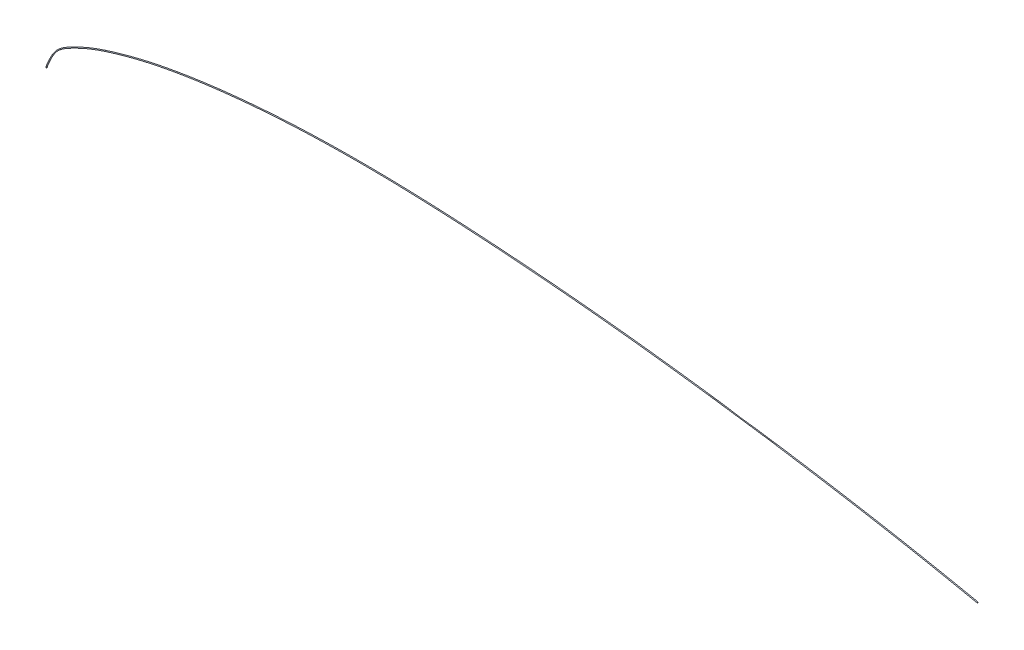
ISO-10303-21;
HEADER;
FILE_DESCRIPTION(('STEP AP214'),'2;1');
FILE_NAME('part.step','',(''),(''),'','','');
FILE_SCHEMA(('AUTOMOTIVE_DESIGN { 1 0 10303 214 1 1 1 1 }'));
ENDSEC;
DATA;
#1=APPLICATION_CONTEXT('core data for automotive mechanical design processes');
#2=APPLICATION_PROTOCOL_DEFINITION('international standard','automotive_design',2000,#1);
#3=PRODUCT_CONTEXT('',#1,'mechanical');
#4=PRODUCT('Part','Part','',(#3));
#5=PRODUCT_RELATED_PRODUCT_CATEGORY('part','',(#4));
#6=PRODUCT_DEFINITION_FORMATION('','',#4);
#7=PRODUCT_DEFINITION_CONTEXT('part definition',#1,'design');
#8=PRODUCT_DEFINITION('design','',#6,#7);
#9=PRODUCT_DEFINITION_SHAPE('','',#8);
#10=(LENGTH_UNIT() NAMED_UNIT(*) SI_UNIT(.MILLI.,.METRE.));
#11=(NAMED_UNIT(*) PLANE_ANGLE_UNIT() SI_UNIT($,.RADIAN.));
#12=(NAMED_UNIT(*) SI_UNIT($,.STERADIAN.) SOLID_ANGLE_UNIT());
#13=UNCERTAINTY_MEASURE_WITH_UNIT(LENGTH_MEASURE(1.E-05),#10,'distance_accuracy_value','');
#14=(GEOMETRIC_REPRESENTATION_CONTEXT(3) GLOBAL_UNCERTAINTY_ASSIGNED_CONTEXT((#13)) GLOBAL_UNIT_ASSIGNED_CONTEXT((#10,
#11,#12)) REPRESENTATION_CONTEXT('',''));
#15=CARTESIAN_POINT('',(0.,0.,0.));
#16=DIRECTION('',(0.,0.,1.));
#17=DIRECTION('',(1.,0.,0.));
#18=AXIS2_PLACEMENT_3D('',#15,#16,#17);
#19=CARTESIAN_POINT('',(982.37,1.277081,0.));
#20=DIRECTION('',(0.98101772640487,0.193918076721638,0.));
#21=DIRECTION('',(0.,0.,1.));
#22=AXIS2_PLACEMENT_3D('',#19,#20,#21);
#23=PLANE('',#22);
#24=CARTESIAN_POINT('',(982.37,1.277081,0.));
#25=DIRECTION('',(0.98101772640487,0.193918076721638,0.));
#26=DIRECTION('',(0.,0.,1.));
#27=AXIS2_PLACEMENT_3D('',#24,#25,#26);
#28=CIRCLE('',#27,0.5);
#29=CARTESIAN_POINT('',(982.37,1.277081,0.5));
#30=VERTEX_POINT('',#29);
#31=EDGE_CURVE('E10',#30,#30,#28,.T.);
#32=ORIENTED_EDGE('',*,*,#31,.T.);
#33=EDGE_LOOP('',(#32));
#34=FACE_BOUND('',#33,.T.);
#35=ADVANCED_FACE('F39',(#34),#23,.T.);
#36=CARTESIAN_POINT('',(982.37,1.277081,0.5));
#37=CARTESIAN_POINT('',(966.006247692632,4.63023753531084,0.5));
#38=CARTESIAN_POINT('',(949.64249538203,7.98339407107312,0.5));
#39=CARTESIAN_POINT('',(884.325588967302,20.7974180113734,0.5));
#40=CARTESIAN_POINT('',(835.170749762555,29.2208354174456,0.5));
#41=CARTESIAN_POINT('',(753.204713954217,41.8930561435161,0.5));
#42=CARTESIAN_POINT('',(720.457598988852,46.5816054311459,0.5));
#43=CARTESIAN_POINT('',(654.965430300209,55.178140371645,0.5));
#44=CARTESIAN_POINT('',(622.220705780157,59.088577507133,0.5));
#45=CARTESIAN_POINT('',(556.72340320794,65.8585389828754,0.5));
#46=CARTESIAN_POINT('',(523.971154173901,68.7212345165416,0.5));
#47=CARTESIAN_POINT('',(458.473890529683,73.5204427017436,0.5));
#48=CARTESIAN_POINT('',(425.729030955599,75.4590603090154,0.5));
#49=CARTESIAN_POINT('',(360.217201786401,77.7888732518948,0.5));
#50=CARTESIAN_POINT('',(327.450342968571,78.1824352617219,0.5));
#51=CARTESIAN_POINT('',(261.903332539602,76.6374663029844,0.5));
#52=CARTESIAN_POINT('',(229.113072819916,74.7211664786091,0.5));
#53=CARTESIAN_POINT('',(179.965527901329,69.5998220072903,0.5));
#54=CARTESIAN_POINT('',(163.498338532072,67.4928260856141,0.5));
#55=CARTESIAN_POINT('',(130.697575950852,62.2949459092975,0.5));
#56=CARTESIAN_POINT('',(114.364585446865,59.2029975403183,0.5));
#57=CARTESIAN_POINT('',(89.9285245792287,53.3005454090448,0.5));
#58=CARTESIAN_POINT('',(81.6745496994335,51.0803969997088,0.5));
#59=CARTESIAN_POINT('',(65.2472627690558,46.243098791399,0.5));
#60=CARTESIAN_POINT('',(57.0755665289918,43.6238149687629,0.5));
#61=CARTESIAN_POINT('',(43.9833416859353,38.6022903177345,0.5));
#62=CARTESIAN_POINT('',(38.9375739069987,36.4525063723427,0.5));
#63=CARTESIAN_POINT('',(31.4498674362683,32.913379283491,0.5));
#64=CARTESIAN_POINT('',(28.9674561457282,31.681261725483,0.5));
#65=CARTESIAN_POINT('',(24.0207585296471,29.1048493398776,0.5));
#66=CARTESIAN_POINT('',(21.5337905450468,27.7759853581103,0.5));
#67=CARTESIAN_POINT('',(16.7882920380453,24.8496141050762,0.5));
#68=CARTESIAN_POINT('',(14.5377722111785,23.2466569766948,0.5));
#69=CARTESIAN_POINT('',(10.5905898574913,19.5373232835405,0.5));
#70=CARTESIAN_POINT('',(8.90492918725965,17.4222238719549,0.5));
#71=CARTESIAN_POINT('',(4.42778144185482,10.5529103062656,0.5));
#72=CARTESIAN_POINT('',(2.21389071966054,5.27645515427274,0.5));
#73=CARTESIAN_POINT('',(0.,0.,0.5));
#74=CARTESIAN_POINT('',(982.563918076722,0.29606327359513,0.5));
#75=CARTESIAN_POINT('',(966.200165767499,3.64921980892499,0.5));
#76=CARTESIAN_POINT('',(949.839160604952,7.00290740477424,0.5));
#77=CARTESIAN_POINT('',(884.544092714158,19.8214389613463,0.5));
#78=CARTESIAN_POINT('',(835.40131775265,28.2477143375043,0.5));
#79=CARTESIAN_POINT('',(753.453418381785,40.9244480332833,0.5));
#80=CARTESIAN_POINT('',(720.713682314235,45.6149192850411,0.5));
#81=CARTESIAN_POINT('',(655.236529757715,54.2155576629643,0.5));
#82=CARTESIAN_POINT('',(622.500629401233,58.1284969837561,0.5));
#83=CARTESIAN_POINT('',(557.023538067243,64.9045839369948,0.5));
#84=CARTESIAN_POINT('',(524.280762680364,67.7703243225816,0.5));
#85=CARTESIAN_POINT('',(458.801225424324,72.5754881578468,0.5));
#86=CARTESIAN_POINT('',(426.06821064823,74.5182073184651,0.5));
#87=CARTESIAN_POINT('',(360.58577013235,76.8591400470335,0.5));
#88=CARTESIAN_POINT('',(327.837209483476,77.2599943142502,0.5));
#89=CARTESIAN_POINT('',(262.333558984971,75.7344322172876,0.5));
#90=CARTESIAN_POINT('',(229.566371993328,73.8292730265615,0.5));
#91=CARTESIAN_POINT('',(180.459619649967,68.730271884403,0.5));
#92=CARTESIAN_POINT('',(164.007817596871,66.6321112630241,0.5));
#93=CARTESIAN_POINT('',(131.241017201513,61.4552611290608,0.5));
#94=CARTESIAN_POINT('',(114.930337108243,58.3777486950091,0.5));
#95=CARTESIAN_POINT('',(90.5349492372928,52.5052191305762,0.5));
#96=CARTESIAN_POINT('',(82.2938385739548,50.2950726401932,0.5));
#97=CARTESIAN_POINT('',(65.8912176146056,45.4778699258685,0.5));
#98=CARTESIAN_POINT('',(57.7398604672087,42.8753977992402,0.5));
#99=CARTESIAN_POINT('',(44.6923426157801,37.8966651450928,0.5));
#100=CARTESIAN_POINT('',(39.664263852104,35.7650613796964,0.5));
#101=CARTESIAN_POINT('',(32.2022911793308,32.2545748857836,0.5));
#102=CARTESIAN_POINT('',(29.7283254048874,31.0322284458354,0.5));
#103=CARTESIAN_POINT('',(24.7981079747776,28.475648205275,0.5));
#104=CARTESIAN_POINT('',(22.3216395958269,27.1585617769766,0.5));
#105=CARTESIAN_POINT('',(17.6271013267159,24.3034300862453,0.5));
#106=CARTESIAN_POINT('',(15.4138163425942,22.7557596830098,0.5));
#107=CARTESIAN_POINT('',(11.5413894191943,19.2141922479197,0.5));
#108=CARTESIAN_POINT('',(9.87748593080348,17.1812874766036,0.5));
#109=CARTESIAN_POINT('',(5.43401535512678,10.4966859659683,0.5));
#110=CARTESIAN_POINT('',(3.21389071965992,5.27645515427274,0.5));
#111=CARTESIAN_POINT('',(1.,0.,0.5));
#112=CARTESIAN_POINT('',(982.563918076722,0.29606327359513,-0.5));
#113=CARTESIAN_POINT('',(966.200165767499,3.64921980892499,-0.5));
#114=CARTESIAN_POINT('',(949.839160604952,7.00290740477424,-0.5));
#115=CARTESIAN_POINT('',(884.544092714158,19.8214389613463,-0.5));
#116=CARTESIAN_POINT('',(835.40131775265,28.2477143375043,-0.5));
#117=CARTESIAN_POINT('',(753.453418381785,40.9244480332833,-0.5));
#118=CARTESIAN_POINT('',(720.713682314235,45.6149192850411,-0.5));
#119=CARTESIAN_POINT('',(655.236529757715,54.2155576629643,-0.5));
#120=CARTESIAN_POINT('',(622.500629401233,58.1284969837561,-0.5));
#121=CARTESIAN_POINT('',(557.023538067243,64.9045839369948,-0.5));
#122=CARTESIAN_POINT('',(524.280762680364,67.7703243225816,-0.5));
#123=CARTESIAN_POINT('',(458.801225424324,72.5754881578468,-0.5));
#124=CARTESIAN_POINT('',(426.06821064823,74.5182073184651,-0.5));
#125=CARTESIAN_POINT('',(360.58577013235,76.8591400470335,-0.5));
#126=CARTESIAN_POINT('',(327.837209483476,77.2599943142502,-0.5));
#127=CARTESIAN_POINT('',(262.333558984971,75.7344322172876,-0.5));
#128=CARTESIAN_POINT('',(229.566371993328,73.8292730265615,-0.5));
#129=CARTESIAN_POINT('',(180.459619649967,68.730271884403,-0.5));
#130=CARTESIAN_POINT('',(164.007817596871,66.6321112630241,-0.5));
#131=CARTESIAN_POINT('',(131.241017201513,61.4552611290608,-0.5));
#132=CARTESIAN_POINT('',(114.930337108243,58.3777486950091,-0.5));
#133=CARTESIAN_POINT('',(90.5349492372928,52.5052191305762,-0.5));
#134=CARTESIAN_POINT('',(82.2938385739548,50.2950726401932,-0.5));
#135=CARTESIAN_POINT('',(65.8912176146056,45.4778699258685,-0.5));
#136=CARTESIAN_POINT('',(57.7398604672087,42.8753977992402,-0.5));
#137=CARTESIAN_POINT('',(44.6923426157801,37.8966651450928,-0.5));
#138=CARTESIAN_POINT('',(39.664263852104,35.7650613796964,-0.5));
#139=CARTESIAN_POINT('',(32.2022911793308,32.2545748857836,-0.5));
#140=CARTESIAN_POINT('',(29.7283254048874,31.0322284458354,-0.5));
#141=CARTESIAN_POINT('',(24.7981079747776,28.475648205275,-0.5));
#142=CARTESIAN_POINT('',(22.3216395958269,27.1585617769766,-0.5));
#143=CARTESIAN_POINT('',(17.6271013267159,24.3034300862453,-0.5));
#144=CARTESIAN_POINT('',(15.4138163425942,22.7557596830098,-0.5));
#145=CARTESIAN_POINT('',(11.5413894191943,19.2141922479197,-0.5));
#146=CARTESIAN_POINT('',(9.87748593080348,17.1812874766036,-0.5));
#147=CARTESIAN_POINT('',(5.43401535512678,10.4966859659683,-0.5));
#148=CARTESIAN_POINT('',(3.21389071965992,5.27645515427274,-0.5));
#149=CARTESIAN_POINT('',(1.,0.,-0.5));
#150=CARTESIAN_POINT('',(982.37,1.277081,-0.5));
#151=CARTESIAN_POINT('',(966.006247692632,4.63023753531084,-0.5));
#152=CARTESIAN_POINT('',(949.64249538203,7.98339407107312,-0.5));
#153=CARTESIAN_POINT('',(884.325588967302,20.7974180113734,-0.5));
#154=CARTESIAN_POINT('',(835.170749762555,29.2208354174456,-0.5));
#155=CARTESIAN_POINT('',(753.204713954217,41.8930561435161,-0.5));
#156=CARTESIAN_POINT('',(720.457598988852,46.5816054311459,-0.5));
#157=CARTESIAN_POINT('',(654.965430300209,55.178140371645,-0.5));
#158=CARTESIAN_POINT('',(622.220705780157,59.088577507133,-0.5));
#159=CARTESIAN_POINT('',(556.72340320794,65.8585389828754,-0.5));
#160=CARTESIAN_POINT('',(523.971154173901,68.7212345165416,-0.5));
#161=CARTESIAN_POINT('',(458.473890529683,73.5204427017436,-0.5));
#162=CARTESIAN_POINT('',(425.729030955599,75.4590603090154,-0.5));
#163=CARTESIAN_POINT('',(360.217201786401,77.7888732518948,-0.5));
#164=CARTESIAN_POINT('',(327.450342968571,78.1824352617219,-0.5));
#165=CARTESIAN_POINT('',(261.903332539602,76.6374663029844,-0.5));
#166=CARTESIAN_POINT('',(229.113072819916,74.7211664786091,-0.5));
#167=CARTESIAN_POINT('',(179.965527901329,69.5998220072903,-0.5));
#168=CARTESIAN_POINT('',(163.498338532072,67.4928260856141,-0.5));
#169=CARTESIAN_POINT('',(130.697575950852,62.2949459092975,-0.5));
#170=CARTESIAN_POINT('',(114.364585446865,59.2029975403183,-0.5));
#171=CARTESIAN_POINT('',(89.9285245792287,53.3005454090448,-0.5));
#172=CARTESIAN_POINT('',(81.6745496994335,51.0803969997088,-0.5));
#173=CARTESIAN_POINT('',(65.2472627690558,46.243098791399,-0.5));
#174=CARTESIAN_POINT('',(57.0755665289918,43.6238149687629,-0.5));
#175=CARTESIAN_POINT('',(43.9833416859353,38.6022903177345,-0.5));
#176=CARTESIAN_POINT('',(38.9375739069987,36.4525063723427,-0.5));
#177=CARTESIAN_POINT('',(31.4498674362683,32.913379283491,-0.5));
#178=CARTESIAN_POINT('',(28.9674561457282,31.681261725483,-0.5));
#179=CARTESIAN_POINT('',(24.0207585296471,29.1048493398776,-0.5));
#180=CARTESIAN_POINT('',(21.5337905450468,27.7759853581103,-0.5));
#181=CARTESIAN_POINT('',(16.7882920380453,24.8496141050762,-0.5));
#182=CARTESIAN_POINT('',(14.5377722111785,23.2466569766948,-0.5));
#183=CARTESIAN_POINT('',(10.5905898574913,19.5373232835405,-0.5));
#184=CARTESIAN_POINT('',(8.90492918725965,17.4222238719549,-0.5));
#185=CARTESIAN_POINT('',(4.42778144185482,10.5529103062656,-0.5));
#186=CARTESIAN_POINT('',(2.21389071966054,5.27645515427274,-0.5));
#187=CARTESIAN_POINT('',(0.,0.,-0.5));
#188=CARTESIAN_POINT('',(982.176081923278,2.25809872640487,-0.5));
#189=CARTESIAN_POINT('',(965.812329617764,5.6112552616967,-0.5));
#190=CARTESIAN_POINT('',(949.445830159108,8.96388073737201,-0.5));
#191=CARTESIAN_POINT('',(884.107085220446,21.7733970614004,-0.5));
#192=CARTESIAN_POINT('',(834.940181772459,30.1939564973869,-0.5));
#193=CARTESIAN_POINT('',(752.95600952665,42.8616642537489,-0.5));
#194=CARTESIAN_POINT('',(720.201515663469,47.5482915772508,-0.5));
#195=CARTESIAN_POINT('',(654.694330842703,56.1407230803257,-0.5));
#196=CARTESIAN_POINT('',(621.940782159082,60.0486580305098,-0.5));
#197=CARTESIAN_POINT('',(556.423268348636,66.8124940287559,-0.5));
#198=CARTESIAN_POINT('',(523.661545667439,69.6721447105017,-0.5));
#199=CARTESIAN_POINT('',(458.146555635041,74.4653972456404,-0.5));
#200=CARTESIAN_POINT('',(425.389851262968,76.3999132995658,-0.5));
#201=CARTESIAN_POINT('',(359.848633440452,78.7186064567562,-0.5));
#202=CARTESIAN_POINT('',(327.063476453665,79.1048762091936,-0.5));
#203=CARTESIAN_POINT('',(261.473106094233,77.5405003886812,-0.5));
#204=CARTESIAN_POINT('',(228.659773646503,75.6130599306568,-0.5));
#205=CARTESIAN_POINT('',(179.471436152691,70.4693721301776,-0.5));
#206=CARTESIAN_POINT('',(162.988859467274,68.3535409082041,-0.5));
#207=CARTESIAN_POINT('',(130.154134700192,63.1346306895341,-0.5));
#208=CARTESIAN_POINT('',(113.798833785488,60.0282463856275,-0.5));
#209=CARTESIAN_POINT('',(89.3220999211647,54.0958716875133,-0.5));
#210=CARTESIAN_POINT('',(81.0552608249122,51.8657213592243,-0.5));
#211=CARTESIAN_POINT('',(64.6033079235059,47.0083276569295,-0.5));
#212=CARTESIAN_POINT('',(56.4112725907748,44.3722321382856,-0.5));
#213=CARTESIAN_POINT('',(43.2743407560905,39.3079154903761,-0.5));
#214=CARTESIAN_POINT('',(38.2108839618934,37.1399513649891,-0.5));
#215=CARTESIAN_POINT('',(30.6974436932059,33.5721836811985,-0.5));
#216=CARTESIAN_POINT('',(28.2065868865691,32.3302950051305,-0.5));
#217=CARTESIAN_POINT('',(23.2434090845165,29.7340504744801,-0.5));
#218=CARTESIAN_POINT('',(20.7459414942667,28.393408939244,-0.5));
#219=CARTESIAN_POINT('',(15.9494827493746,25.3957981239071,-0.5));
#220=CARTESIAN_POINT('',(13.6617280797627,23.7375542703798,-0.5));
#221=CARTESIAN_POINT('',(9.63979029578835,19.8604543191613,-0.5));
#222=CARTESIAN_POINT('',(7.93237244371581,17.6631602673063,-0.5));
#223=CARTESIAN_POINT('',(3.42154752858286,10.6091346465629,-0.5));
#224=CARTESIAN_POINT('',(1.21389071966116,5.27645515427274,-0.5));
#225=CARTESIAN_POINT('',(-1.,0.,-0.5));
#226=CARTESIAN_POINT('',(982.176081923278,2.25809872640487,0.5));
#227=CARTESIAN_POINT('',(965.812329617764,5.6112552616967,0.5));
#228=CARTESIAN_POINT('',(949.445830159108,8.96388073737201,0.5));
#229=CARTESIAN_POINT('',(884.107085220446,21.7733970614004,0.5));
#230=CARTESIAN_POINT('',(834.940181772459,30.1939564973869,0.5));
#231=CARTESIAN_POINT('',(752.95600952665,42.8616642537489,0.5));
#232=CARTESIAN_POINT('',(720.201515663469,47.5482915772508,0.5));
#233=CARTESIAN_POINT('',(654.694330842703,56.1407230803257,0.5));
#234=CARTESIAN_POINT('',(621.940782159082,60.0486580305098,0.5));
#235=CARTESIAN_POINT('',(556.423268348636,66.8124940287559,0.5));
#236=CARTESIAN_POINT('',(523.661545667439,69.6721447105017,0.5));
#237=CARTESIAN_POINT('',(458.146555635041,74.4653972456404,0.5));
#238=CARTESIAN_POINT('',(425.389851262968,76.3999132995658,0.5));
#239=CARTESIAN_POINT('',(359.848633440452,78.7186064567562,0.5));
#240=CARTESIAN_POINT('',(327.063476453665,79.1048762091936,0.5));
#241=CARTESIAN_POINT('',(261.473106094233,77.5405003886812,0.5));
#242=CARTESIAN_POINT('',(228.659773646503,75.6130599306568,0.5));
#243=CARTESIAN_POINT('',(179.471436152691,70.4693721301776,0.5));
#244=CARTESIAN_POINT('',(162.988859467274,68.3535409082041,0.5));
#245=CARTESIAN_POINT('',(130.154134700192,63.1346306895341,0.5));
#246=CARTESIAN_POINT('',(113.798833785488,60.0282463856275,0.5));
#247=CARTESIAN_POINT('',(89.3220999211647,54.0958716875133,0.5));
#248=CARTESIAN_POINT('',(81.0552608249122,51.8657213592243,0.5));
#249=CARTESIAN_POINT('',(64.6033079235059,47.0083276569295,0.5));
#250=CARTESIAN_POINT('',(56.4112725907748,44.3722321382856,0.5));
#251=CARTESIAN_POINT('',(43.2743407560905,39.3079154903761,0.5));
#252=CARTESIAN_POINT('',(38.2108839618934,37.1399513649891,0.5));
#253=CARTESIAN_POINT('',(30.6974436932059,33.5721836811985,0.5));
#254=CARTESIAN_POINT('',(28.2065868865691,32.3302950051305,0.5));
#255=CARTESIAN_POINT('',(23.2434090845165,29.7340504744801,0.5));
#256=CARTESIAN_POINT('',(20.7459414942667,28.393408939244,0.5));
#257=CARTESIAN_POINT('',(15.9494827493746,25.3957981239071,0.5));
#258=CARTESIAN_POINT('',(13.6617280797627,23.7375542703798,0.5));
#259=CARTESIAN_POINT('',(9.63979029578835,19.8604543191613,0.5));
#260=CARTESIAN_POINT('',(7.93237244371581,17.6631602673063,0.5));
#261=CARTESIAN_POINT('',(3.42154752858286,10.6091346465629,0.5));
#262=CARTESIAN_POINT('',(1.21389071966116,5.27645515427274,0.5));
#263=CARTESIAN_POINT('',(-1.,0.,0.5));
#264=CARTESIAN_POINT('',(982.37,1.277081,0.5));
#265=CARTESIAN_POINT('',(966.006247692632,4.63023753531084,0.5));
#266=CARTESIAN_POINT('',(949.64249538203,7.98339407107312,0.5));
#267=CARTESIAN_POINT('',(884.325588967302,20.7974180113734,0.5));
#268=CARTESIAN_POINT('',(835.170749762555,29.2208354174456,0.5));
#269=CARTESIAN_POINT('',(753.204713954217,41.8930561435161,0.5));
#270=CARTESIAN_POINT('',(720.457598988852,46.5816054311459,0.5));
#271=CARTESIAN_POINT('',(654.965430300209,55.178140371645,0.5));
#272=CARTESIAN_POINT('',(622.220705780157,59.088577507133,0.5));
#273=CARTESIAN_POINT('',(556.72340320794,65.8585389828754,0.5));
#274=CARTESIAN_POINT('',(523.971154173901,68.7212345165416,0.5));
#275=CARTESIAN_POINT('',(458.473890529683,73.5204427017436,0.5));
#276=CARTESIAN_POINT('',(425.729030955599,75.4590603090154,0.5));
#277=CARTESIAN_POINT('',(360.217201786401,77.7888732518948,0.5));
#278=CARTESIAN_POINT('',(327.450342968571,78.1824352617219,0.5));
#279=CARTESIAN_POINT('',(261.903332539602,76.6374663029844,0.5));
#280=CARTESIAN_POINT('',(229.113072819916,74.7211664786091,0.5));
#281=CARTESIAN_POINT('',(179.965527901329,69.5998220072903,0.5));
#282=CARTESIAN_POINT('',(163.498338532072,67.4928260856141,0.5));
#283=CARTESIAN_POINT('',(130.697575950852,62.2949459092975,0.5));
#284=CARTESIAN_POINT('',(114.364585446865,59.2029975403183,0.5));
#285=CARTESIAN_POINT('',(89.9285245792287,53.3005454090448,0.5));
#286=CARTESIAN_POINT('',(81.6745496994335,51.0803969997088,0.5));
#287=CARTESIAN_POINT('',(65.2472627690558,46.243098791399,0.5));
#288=CARTESIAN_POINT('',(57.0755665289918,43.6238149687629,0.5));
#289=CARTESIAN_POINT('',(43.9833416859353,38.6022903177345,0.5));
#290=CARTESIAN_POINT('',(38.9375739069987,36.4525063723427,0.5));
#291=CARTESIAN_POINT('',(31.4498674362683,32.913379283491,0.5));
#292=CARTESIAN_POINT('',(28.9674561457282,31.681261725483,0.5));
#293=CARTESIAN_POINT('',(24.0207585296471,29.1048493398776,0.5));
#294=CARTESIAN_POINT('',(21.5337905450468,27.7759853581103,0.5));
#295=CARTESIAN_POINT('',(16.7882920380453,24.8496141050762,0.5));
#296=CARTESIAN_POINT('',(14.5377722111785,23.2466569766948,0.5));
#297=CARTESIAN_POINT('',(10.5905898574913,19.5373232835405,0.5));
#298=CARTESIAN_POINT('',(8.90492918725965,17.4222238719549,0.5));
#299=CARTESIAN_POINT('',(4.42778144185482,10.5529103062656,0.5));
#300=CARTESIAN_POINT('',(2.21389071966054,5.27645515427274,0.5));
#301=CARTESIAN_POINT('',(0.,0.,0.5));
#302=(BOUNDED_SURFACE() B_SPLINE_SURFACE(3,3,((#36,#37,#38,#39,#40,#41,#42,#43,#44,#45,#46,#47,
#48,#49,#50,#51,#52,#53,#54,#55,#56,#57,#58,#59,#60,#61,#62,#63,#64,#65,#66,#67,#68,#69,#70,#71,
#72,#73),(#74,#75,#76,#77,#78,#79,#80,#81,#82,#83,#84,#85,#86,#87,#88,#89,#90,#91,#92,#93,#94,
#95,#96,#97,#98,#99,#100,#101,#102,#103,#104,#105,#106,#107,#108,#109,#110,#111),(#112,#113,
#114,#115,#116,#117,#118,#119,#120,#121,#122,#123,#124,#125,#126,#127,#128,#129,#130,#131,#132,
#133,#134,#135,#136,#137,#138,#139,#140,#141,#142,#143,#144,#145,#146,#147,#148,#149),(#150,
#151,#152,#153,#154,#155,#156,#157,#158,#159,#160,#161,#162,#163,#164,#165,#166,#167,#168,#169,
#170,#171,#172,#173,#174,#175,#176,#177,#178,#179,#180,#181,#182,#183,#184,#185,#186,#187),
(#188,#189,#190,#191,#192,#193,#194,#195,#196,#197,#198,#199,#200,#201,#202,#203,#204,#205,#206,
#207,#208,#209,#210,#211,#212,#213,#214,#215,#216,#217,#218,#219,#220,#221,#222,#223,#224,#225),
(#226,#227,#228,#229,#230,#231,#232,#233,#234,#235,#236,#237,#238,#239,#240,#241,#242,#243,#244,
#245,#246,#247,#248,#249,#250,#251,#252,#253,#254,#255,#256,#257,#258,#259,#260,#261,#262,#263),
(#264,#265,#266,#267,#268,#269,#270,#271,#272,#273,#274,#275,#276,#277,#278,#279,#280,#281,#282,
#283,#284,#285,#286,#287,#288,#289,#290,#291,#292,#293,#294,#295,#296,#297,#298,#299,#300,
#301)),.UNSPECIFIED.,.T.,.F.,.F.) B_SPLINE_SURFACE_WITH_KNOTS((4,3,4),(4,2,2,2,2,2,2,2,2,2,2,2,
2,2,2,2,2,2,4),(0.,0.5,1.),(0.,0.0496812988513002,0.197976307844625,0.296362491062684,
0.394433617199178,0.492205408317245,0.589753408165241,0.68715192816571,0.784753711389578,
0.834119584128113,0.883485456866648,0.908917356863356,0.934349256860064,0.950761942645048,
0.95896828553754,0.967174628430032,0.975380971322524,0.983587314215016,1.),
.UNSPECIFIED.) GEOMETRIC_REPRESENTATION_ITEM() RATIONAL_B_SPLINE_SURFACE(((1.,1.,1.,1.,1.,1.,1.,
1.,1.,1.,1.,1.,1.,1.,1.,1.,1.,1.,1.,1.,1.,1.,1.,1.,1.,1.,1.,1.,1.,1.,1.,1.,1.,1.,1.,1.,1.,1.),
(0.333333333333333,0.333333333333333,0.333333333333333,0.333333333333333,0.333333333333333,
0.333333333333333,0.333333333333333,0.333333333333333,0.333333333333333,0.333333333333333,
0.333333333333333,0.333333333333333,0.333333333333333,0.333333333333333,0.333333333333333,
0.333333333333333,0.333333333333333,0.333333333333333,0.333333333333333,0.333333333333333,
0.333333333333333,0.333333333333333,0.333333333333333,0.333333333333333,0.333333333333333,
0.333333333333333,0.333333333333333,0.333333333333333,0.333333333333333,0.333333333333333,
0.333333333333333,0.333333333333333,0.333333333333333,0.333333333333333,0.333333333333333,
0.333333333333333,0.333333333333333,0.333333333333333),(0.333333333333333,0.333333333333333,
0.333333333333333,0.333333333333333,0.333333333333333,0.333333333333333,0.333333333333333,
0.333333333333333,0.333333333333333,0.333333333333333,0.333333333333333,0.333333333333333,
0.333333333333333,0.333333333333333,0.333333333333333,0.333333333333333,0.333333333333333,
0.333333333333333,0.333333333333333,0.333333333333333,0.333333333333333,0.333333333333333,
0.333333333333333,0.333333333333333,0.333333333333333,0.333333333333333,0.333333333333333,
0.333333333333333,0.333333333333333,0.333333333333333,0.333333333333333,0.333333333333333,
0.333333333333333,0.333333333333333,0.333333333333333,0.333333333333333,0.333333333333333,
0.333333333333333),(1.,1.,1.,1.,1.,1.,1.,1.,1.,1.,1.,1.,1.,1.,1.,1.,1.,1.,1.,1.,1.,1.,1.,1.,1.,
1.,1.,1.,1.,1.,1.,1.,1.,1.,1.,1.,1.,1.),(0.333333333333333,0.333333333333333,0.333333333333333,
0.333333333333333,0.333333333333333,0.333333333333333,0.333333333333333,0.333333333333333,
0.333333333333333,0.333333333333333,0.333333333333333,0.333333333333333,0.333333333333333,
0.333333333333333,0.333333333333333,0.333333333333333,0.333333333333333,0.333333333333333,
0.333333333333333,0.333333333333333,0.333333333333333,0.333333333333333,0.333333333333333,
0.333333333333333,0.333333333333333,0.333333333333333,0.333333333333333,0.333333333333333,
0.333333333333333,0.333333333333333,0.333333333333333,0.333333333333333,0.333333333333333,
0.333333333333333,0.333333333333333,0.333333333333333,0.333333333333333,0.333333333333333),
(0.333333333333333,0.333333333333333,0.333333333333333,0.333333333333333,0.333333333333333,
0.333333333333333,0.333333333333333,0.333333333333333,0.333333333333333,0.333333333333333,
0.333333333333333,0.333333333333333,0.333333333333333,0.333333333333333,0.333333333333333,
0.333333333333333,0.333333333333333,0.333333333333333,0.333333333333333,0.333333333333333,
0.333333333333333,0.333333333333333,0.333333333333333,0.333333333333333,0.333333333333333,
0.333333333333333,0.333333333333333,0.333333333333333,0.333333333333333,0.333333333333333,
0.333333333333333,0.333333333333333,0.333333333333333,0.333333333333333,0.333333333333333,
0.333333333333333,0.333333333333333,0.333333333333333),(1.,1.,1.,1.,1.,1.,1.,1.,1.,1.,1.,1.,1.,
1.,1.,1.,1.,1.,1.,1.,1.,1.,1.,1.,1.,1.,1.,1.,1.,1.,1.,1.,1.,1.,1.,1.,1.,1.))) REPRESENTATION_ITEM('') SURFACE());
#303=CARTESIAN_POINT('',(0.,0.,0.));
#304=DIRECTION('',(0.,1.,0.));
#305=DIRECTION('',(0.,0.,1.));
#306=AXIS2_PLACEMENT_3D('',#303,#304,#305);
#307=CIRCLE('',#306,0.5);
#308=CARTESIAN_POINT('',(0.,0.,0.5));
#309=VERTEX_POINT('',#308);
#310=EDGE_CURVE('E49',#309,#309,#307,.T.);
#311=ORIENTED_EDGE('',*,*,#310,.T.);
#312=EDGE_LOOP('',(#311));
#313=FACE_BOUND('',#312,.T.);
#314=ORIENTED_EDGE('',*,*,#31,.F.);
#315=EDGE_LOOP('',(#314));
#316=FACE_BOUND('',#315,.T.);
#317=ADVANCED_FACE('F56',(#313,#316),#302,.F.);
#318=CARTESIAN_POINT('',(0.,-1.,0.));
#319=DIRECTION('',(0.,1.,0.));
#320=DIRECTION('',(0.,0.,1.));
#321=AXIS2_PLACEMENT_3D('',#318,#319,#320);
#322=CYLINDRICAL_SURFACE('',#321,0.5);
#323=CARTESIAN_POINT('',(0.,-1.,0.));
#324=DIRECTION('',(0.,1.,0.));
#325=DIRECTION('',(0.,0.,1.));
#326=AXIS2_PLACEMENT_3D('',#323,#324,#325);
#327=CIRCLE('',#326,0.5);
#328=CARTESIAN_POINT('',(0.,-1.,0.5));
#329=VERTEX_POINT('',#328);
#330=EDGE_CURVE('E45',#329,#329,#327,.T.);
#331=ORIENTED_EDGE('',*,*,#330,.T.);
#332=EDGE_LOOP('',(#331));
#333=FACE_BOUND('',#332,.T.);
#334=ORIENTED_EDGE('',*,*,#310,.F.);
#335=EDGE_LOOP('',(#334));
#336=FACE_BOUND('',#335,.T.);
#337=ADVANCED_FACE('F59',(#333,#336),#322,.T.);
#338=CARTESIAN_POINT('',(0.,-1.,0.));
#339=DIRECTION('',(0.,1.,0.));
#340=DIRECTION('',(0.,0.,1.));
#341=AXIS2_PLACEMENT_3D('',#338,#339,#340);
#342=PLANE('',#341);
#343=ORIENTED_EDGE('',*,*,#330,.F.);
#344=EDGE_LOOP('',(#343));
#345=FACE_BOUND('',#344,.T.);
#346=ADVANCED_FACE('F61',(#345),#342,.F.);
#347=CLOSED_SHELL('',(#35,#317,#337,#346));
#348=MANIFOLD_SOLID_BREP('B2',#347);
#349=ADVANCED_BREP_SHAPE_REPRESENTATION('',(#18,#348),#14);
#350=SHAPE_DEFINITION_REPRESENTATION(#9,#349);
ENDSEC;
END-ISO-10303-21;
